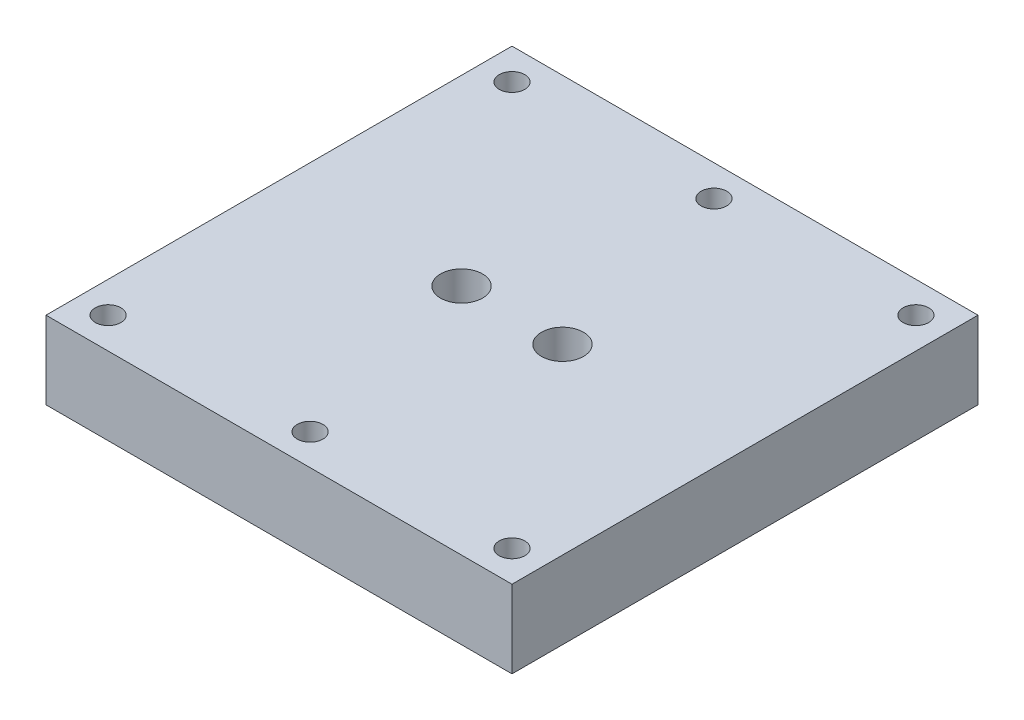
ISO-10303-21;
HEADER;
FILE_DESCRIPTION(('STEP AP214'),'2;1');
FILE_NAME('part.step','',(''),(''),'','','');
FILE_SCHEMA(('AUTOMOTIVE_DESIGN { 1 0 10303 214 1 1 1 1 }'));
ENDSEC;
DATA;
#1=APPLICATION_CONTEXT('core data for automotive mechanical design processes');
#2=APPLICATION_PROTOCOL_DEFINITION('international standard','automotive_design',2000,#1);
#3=PRODUCT_CONTEXT('',#1,'mechanical');
#4=PRODUCT('Part','Part','',(#3));
#5=PRODUCT_RELATED_PRODUCT_CATEGORY('part','',(#4));
#6=PRODUCT_DEFINITION_FORMATION('','',#4);
#7=PRODUCT_DEFINITION_CONTEXT('part definition',#1,'design');
#8=PRODUCT_DEFINITION('design','',#6,#7);
#9=PRODUCT_DEFINITION_SHAPE('','',#8);
#10=(LENGTH_UNIT() NAMED_UNIT(*) SI_UNIT(.MILLI.,.METRE.));
#11=(NAMED_UNIT(*) PLANE_ANGLE_UNIT() SI_UNIT($,.RADIAN.));
#12=(NAMED_UNIT(*) SI_UNIT($,.STERADIAN.) SOLID_ANGLE_UNIT());
#13=UNCERTAINTY_MEASURE_WITH_UNIT(LENGTH_MEASURE(1.E-05),#10,'distance_accuracy_value','');
#14=(GEOMETRIC_REPRESENTATION_CONTEXT(3) GLOBAL_UNCERTAINTY_ASSIGNED_CONTEXT((#13)) GLOBAL_UNIT_ASSIGNED_CONTEXT((#10,
#11,#12)) REPRESENTATION_CONTEXT('',''));
#15=CARTESIAN_POINT('',(0.,0.,0.));
#16=DIRECTION('',(0.,0.,1.));
#17=DIRECTION('',(1.,0.,0.));
#18=AXIS2_PLACEMENT_3D('',#15,#16,#17);
#19=CARTESIAN_POINT('',(-30.,10.,30.));
#20=DIRECTION('',(1.,0.,0.));
#21=DIRECTION('',(0.,0.,-1.));
#22=AXIS2_PLACEMENT_3D('',#19,#20,#21);
#23=PLANE('',#22);
#24=DIRECTION('',(0.,0.,1.));
#25=VECTOR('',#24,1.);
#26=CARTESIAN_POINT('',(-30.,0.,30.));
#27=LINE('',#26,#25);
#28=CARTESIAN_POINT('',(-30.,0.,-30.));
#29=VERTEX_POINT('',#28);
#30=CARTESIAN_POINT('',(-30.,0.,30.));
#31=VERTEX_POINT('',#30);
#32=EDGE_CURVE('E101',#29,#31,#27,.T.);
#33=ORIENTED_EDGE('',*,*,#32,.T.);
#34=DIRECTION('',(0.,-1.,0.));
#35=VECTOR('',#34,1.);
#36=CARTESIAN_POINT('',(-30.,10.,30.));
#37=LINE('',#36,#35);
#38=CARTESIAN_POINT('',(-30.,10.,30.));
#39=VERTEX_POINT('',#38);
#40=EDGE_CURVE('E11',#39,#31,#37,.T.);
#41=ORIENTED_EDGE('',*,*,#40,.F.);
#42=DIRECTION('',(0.,0.,1.));
#43=VECTOR('',#42,1.);
#44=CARTESIAN_POINT('',(-30.,10.,30.));
#45=LINE('',#44,#43);
#46=CARTESIAN_POINT('',(-30.,10.,-30.));
#47=VERTEX_POINT('',#46);
#48=EDGE_CURVE('E89',#47,#39,#45,.T.);
#49=ORIENTED_EDGE('',*,*,#48,.F.);
#50=DIRECTION('',(0.,-1.,0.));
#51=VECTOR('',#50,1.);
#52=CARTESIAN_POINT('',(-30.,10.,-30.));
#53=LINE('',#52,#51);
#54=EDGE_CURVE('E97',#47,#29,#53,.T.);
#55=ORIENTED_EDGE('',*,*,#54,.T.);
#56=EDGE_LOOP('',(#33,#41,#49,#55));
#57=FACE_BOUND('',#56,.T.);
#58=ADVANCED_FACE('F38',(#57),#23,.F.);
#59=CARTESIAN_POINT('',(30.,10.,30.));
#60=DIRECTION('',(0.,0.,-1.));
#61=DIRECTION('',(-1.,0.,0.));
#62=AXIS2_PLACEMENT_3D('',#59,#60,#61);
#63=PLANE('',#62);
#64=DIRECTION('',(1.,0.,0.));
#65=VECTOR('',#64,1.);
#66=CARTESIAN_POINT('',(30.,0.,30.));
#67=LINE('',#66,#65);
#68=CARTESIAN_POINT('',(30.,0.,30.));
#69=VERTEX_POINT('',#68);
#70=EDGE_CURVE('E93',#31,#69,#67,.T.);
#71=ORIENTED_EDGE('',*,*,#70,.T.);
#72=DIRECTION('',(0.,-1.,0.));
#73=VECTOR('',#72,1.);
#74=CARTESIAN_POINT('',(30.,10.,30.));
#75=LINE('',#74,#73);
#76=CARTESIAN_POINT('',(30.,10.,30.));
#77=VERTEX_POINT('',#76);
#78=EDGE_CURVE('E46',#77,#69,#75,.T.);
#79=ORIENTED_EDGE('',*,*,#78,.F.);
#80=DIRECTION('',(1.,0.,0.));
#81=VECTOR('',#80,1.);
#82=CARTESIAN_POINT('',(30.,10.,30.));
#83=LINE('',#82,#81);
#84=EDGE_CURVE('E84',#39,#77,#83,.T.);
#85=ORIENTED_EDGE('',*,*,#84,.F.);
#86=ORIENTED_EDGE('',*,*,#40,.T.);
#87=EDGE_LOOP('',(#71,#79,#85,#86));
#88=FACE_BOUND('',#87,.T.);
#89=ADVANCED_FACE('F92',(#88),#63,.F.);
#90=CARTESIAN_POINT('',(30.,10.,30.));
#91=DIRECTION('',(-1.,0.,0.));
#92=DIRECTION('',(0.,0.,1.));
#93=AXIS2_PLACEMENT_3D('',#90,#91,#92);
#94=PLANE('',#93);
#95=DIRECTION('',(0.,0.,-1.));
#96=VECTOR('',#95,1.);
#97=CARTESIAN_POINT('',(30.,0.,30.));
#98=LINE('',#97,#96);
#99=CARTESIAN_POINT('',(30.,0.,-30.));
#100=VERTEX_POINT('',#99);
#101=EDGE_CURVE('E71',#69,#100,#98,.T.);
#102=ORIENTED_EDGE('',*,*,#101,.T.);
#103=DIRECTION('',(0.,-1.,0.));
#104=VECTOR('',#103,1.);
#105=CARTESIAN_POINT('',(30.,10.,-30.));
#106=LINE('',#105,#104);
#107=CARTESIAN_POINT('',(30.,10.,-30.));
#108=VERTEX_POINT('',#107);
#109=EDGE_CURVE('E94',#108,#100,#106,.T.);
#110=ORIENTED_EDGE('',*,*,#109,.F.);
#111=DIRECTION('',(0.,0.,-1.));
#112=VECTOR('',#111,1.);
#113=CARTESIAN_POINT('',(30.,10.,30.));
#114=LINE('',#113,#112);
#115=EDGE_CURVE('E87',#77,#108,#114,.T.);
#116=ORIENTED_EDGE('',*,*,#115,.F.);
#117=ORIENTED_EDGE('',*,*,#78,.T.);
#118=EDGE_LOOP('',(#102,#110,#116,#117));
#119=FACE_BOUND('',#118,.T.);
#120=ADVANCED_FACE('F95',(#119),#94,.F.);
#121=CARTESIAN_POINT('',(30.,10.,-30.));
#122=DIRECTION('',(0.,0.,1.));
#123=DIRECTION('',(1.,0.,0.));
#124=AXIS2_PLACEMENT_3D('',#121,#122,#123);
#125=PLANE('',#124);
#126=DIRECTION('',(-1.,0.,0.));
#127=VECTOR('',#126,1.);
#128=CARTESIAN_POINT('',(30.,0.,-30.));
#129=LINE('',#128,#127);
#130=EDGE_CURVE('E77',#100,#29,#129,.T.);
#131=ORIENTED_EDGE('',*,*,#130,.T.);
#132=ORIENTED_EDGE('',*,*,#54,.F.);
#133=DIRECTION('',(-1.,0.,0.));
#134=VECTOR('',#133,1.);
#135=CARTESIAN_POINT('',(30.,10.,-30.));
#136=LINE('',#135,#134);
#137=EDGE_CURVE('E54',#108,#47,#136,.T.);
#138=ORIENTED_EDGE('',*,*,#137,.F.);
#139=ORIENTED_EDGE('',*,*,#109,.T.);
#140=EDGE_LOOP('',(#131,#132,#138,#139));
#141=FACE_BOUND('',#140,.T.);
#142=ADVANCED_FACE('F109',(#141),#125,.F.);
#143=CARTESIAN_POINT('',(0.,10.,0.));
#144=DIRECTION('',(0.,1.,0.));
#145=DIRECTION('',(0.,0.,1.));
#146=AXIS2_PLACEMENT_3D('',#143,#144,#145);
#147=PLANE('',#146);
#148=CARTESIAN_POINT('',(-6.5,10.,0.));
#149=DIRECTION('',(0.,1.,0.));
#150=DIRECTION('',(0.,0.,1.));
#151=AXIS2_PLACEMENT_3D('',#148,#149,#150);
#152=CIRCLE('',#151,2.70509999999999);
#153=CARTESIAN_POINT('',(-6.5,10.,2.70509999999999));
#154=VERTEX_POINT('',#153);
#155=EDGE_CURVE('E159',#154,#154,#152,.T.);
#156=ORIENTED_EDGE('',*,*,#155,.F.);
#157=EDGE_LOOP('',(#156));
#158=FACE_BOUND('',#157,.T.);
#159=CARTESIAN_POINT('',(6.5,10.,0.));
#160=DIRECTION('',(0.,1.,0.));
#161=DIRECTION('',(0.,0.,1.));
#162=AXIS2_PLACEMENT_3D('',#159,#160,#161);
#163=CIRCLE('',#162,2.70509999999999);
#164=CARTESIAN_POINT('',(6.5,10.,2.70509999999999));
#165=VERTEX_POINT('',#164);
#166=EDGE_CURVE('E153',#165,#165,#163,.T.);
#167=ORIENTED_EDGE('',*,*,#166,.F.);
#168=EDGE_LOOP('',(#167));
#169=FACE_BOUND('',#168,.T.);
#170=CARTESIAN_POINT('',(0.,10.,-26.));
#171=DIRECTION('',(0.,1.,0.));
#172=DIRECTION('',(0.,0.,1.));
#173=AXIS2_PLACEMENT_3D('',#170,#171,#172);
#174=CIRCLE('',#173,1.65);
#175=CARTESIAN_POINT('',(0.,10.,-24.35));
#176=VERTEX_POINT('',#175);
#177=EDGE_CURVE('E144',#176,#176,#174,.T.);
#178=ORIENTED_EDGE('',*,*,#177,.F.);
#179=EDGE_LOOP('',(#178));
#180=FACE_BOUND('',#179,.T.);
#181=CARTESIAN_POINT('',(-26.,10.,-26.));
#182=DIRECTION('',(0.,1.,0.));
#183=DIRECTION('',(0.,0.,1.));
#184=AXIS2_PLACEMENT_3D('',#181,#182,#183);
#185=CIRCLE('',#184,1.65);
#186=CARTESIAN_POINT('',(-26.,10.,-24.35));
#187=VERTEX_POINT('',#186);
#188=EDGE_CURVE('E138',#187,#187,#185,.T.);
#189=ORIENTED_EDGE('',*,*,#188,.F.);
#190=EDGE_LOOP('',(#189));
#191=FACE_BOUND('',#190,.T.);
#192=CARTESIAN_POINT('',(26.,10.,-26.));
#193=DIRECTION('',(0.,1.,0.));
#194=DIRECTION('',(0.,0.,1.));
#195=AXIS2_PLACEMENT_3D('',#192,#193,#194);
#196=CIRCLE('',#195,1.65);
#197=CARTESIAN_POINT('',(26.,10.,-24.35));
#198=VERTEX_POINT('',#197);
#199=EDGE_CURVE('E132',#198,#198,#196,.T.);
#200=ORIENTED_EDGE('',*,*,#199,.F.);
#201=EDGE_LOOP('',(#200));
#202=FACE_BOUND('',#201,.T.);
#203=CARTESIAN_POINT('',(26.,10.,26.));
#204=DIRECTION('',(0.,1.,0.));
#205=DIRECTION('',(0.,0.,1.));
#206=AXIS2_PLACEMENT_3D('',#203,#204,#205);
#207=CIRCLE('',#206,1.65);
#208=CARTESIAN_POINT('',(26.,10.,27.65));
#209=VERTEX_POINT('',#208);
#210=EDGE_CURVE('E126',#209,#209,#207,.T.);
#211=ORIENTED_EDGE('',*,*,#210,.F.);
#212=EDGE_LOOP('',(#211));
#213=FACE_BOUND('',#212,.T.);
#214=CARTESIAN_POINT('',(0.,10.,26.));
#215=DIRECTION('',(0.,1.,0.));
#216=DIRECTION('',(0.,0.,1.));
#217=AXIS2_PLACEMENT_3D('',#214,#215,#216);
#218=CIRCLE('',#217,1.65);
#219=CARTESIAN_POINT('',(0.,10.,27.65));
#220=VERTEX_POINT('',#219);
#221=EDGE_CURVE('E120',#220,#220,#218,.T.);
#222=ORIENTED_EDGE('',*,*,#221,.F.);
#223=EDGE_LOOP('',(#222));
#224=FACE_BOUND('',#223,.T.);
#225=CARTESIAN_POINT('',(-26.,10.,26.));
#226=DIRECTION('',(0.,1.,0.));
#227=DIRECTION('',(0.,0.,1.));
#228=AXIS2_PLACEMENT_3D('',#225,#226,#227);
#229=CIRCLE('',#228,1.65);
#230=CARTESIAN_POINT('',(-26.,10.,27.65));
#231=VERTEX_POINT('',#230);
#232=EDGE_CURVE('E104',#231,#231,#229,.T.);
#233=ORIENTED_EDGE('',*,*,#232,.F.);
#234=EDGE_LOOP('',(#233));
#235=FACE_BOUND('',#234,.T.);
#236=ORIENTED_EDGE('',*,*,#48,.T.);
#237=ORIENTED_EDGE('',*,*,#84,.T.);
#238=ORIENTED_EDGE('',*,*,#115,.T.);
#239=ORIENTED_EDGE('',*,*,#137,.T.);
#240=EDGE_LOOP('',(#236,#237,#238,#239));
#241=FACE_BOUND('',#240,.T.);
#242=ADVANCED_FACE('F85',(#158,#169,#180,#191,#202,#213,#224,#235,#241),#147,.T.);
#243=CARTESIAN_POINT('',(0.,0.,0.));
#244=DIRECTION('',(0.,1.,0.));
#245=DIRECTION('',(0.,0.,1.));
#246=AXIS2_PLACEMENT_3D('',#243,#244,#245);
#247=PLANE('',#246);
#248=CARTESIAN_POINT('',(-6.5,0.,0.));
#249=DIRECTION('',(0.,1.,0.));
#250=DIRECTION('',(0.,0.,1.));
#251=AXIS2_PLACEMENT_3D('',#248,#249,#250);
#252=CIRCLE('',#251,0.499999999999995);
#253=CARTESIAN_POINT('',(-6.5,0.,0.499999999999995));
#254=VERTEX_POINT('',#253);
#255=EDGE_CURVE('E171',#254,#254,#252,.T.);
#256=ORIENTED_EDGE('',*,*,#255,.T.);
#257=EDGE_LOOP('',(#256));
#258=FACE_BOUND('',#257,.T.);
#259=CARTESIAN_POINT('',(6.5,0.,0.));
#260=DIRECTION('',(0.,1.,0.));
#261=DIRECTION('',(0.,0.,1.));
#262=AXIS2_PLACEMENT_3D('',#259,#260,#261);
#263=CIRCLE('',#262,0.499999999999995);
#264=CARTESIAN_POINT('',(6.5,0.,0.499999999999997));
#265=VERTEX_POINT('',#264);
#266=EDGE_CURVE('E165',#265,#265,#263,.T.);
#267=ORIENTED_EDGE('',*,*,#266,.T.);
#268=EDGE_LOOP('',(#267));
#269=FACE_BOUND('',#268,.T.);
#270=CARTESIAN_POINT('',(0.,0.,-26.));
#271=DIRECTION('',(0.,-1.,0.));
#272=DIRECTION('',(0.,0.,-1.));
#273=AXIS2_PLACEMENT_3D('',#270,#271,#272);
#274=CIRCLE('',#273,1.65);
#275=CARTESIAN_POINT('',(0.,0.,-27.65));
#276=VERTEX_POINT('',#275);
#277=EDGE_CURVE('E147',#276,#276,#274,.T.);
#278=ORIENTED_EDGE('',*,*,#277,.F.);
#279=EDGE_LOOP('',(#278));
#280=FACE_BOUND('',#279,.T.);
#281=CARTESIAN_POINT('',(-26.,0.,-26.));
#282=DIRECTION('',(0.,-1.,0.));
#283=DIRECTION('',(0.,0.,-1.));
#284=AXIS2_PLACEMENT_3D('',#281,#282,#283);
#285=CIRCLE('',#284,1.65);
#286=CARTESIAN_POINT('',(-26.,0.,-27.65));
#287=VERTEX_POINT('',#286);
#288=EDGE_CURVE('E141',#287,#287,#285,.T.);
#289=ORIENTED_EDGE('',*,*,#288,.F.);
#290=EDGE_LOOP('',(#289));
#291=FACE_BOUND('',#290,.T.);
#292=CARTESIAN_POINT('',(26.,0.,-26.));
#293=DIRECTION('',(0.,-1.,0.));
#294=DIRECTION('',(0.,0.,-1.));
#295=AXIS2_PLACEMENT_3D('',#292,#293,#294);
#296=CIRCLE('',#295,1.65);
#297=CARTESIAN_POINT('',(26.,0.,-27.65));
#298=VERTEX_POINT('',#297);
#299=EDGE_CURVE('E135',#298,#298,#296,.T.);
#300=ORIENTED_EDGE('',*,*,#299,.F.);
#301=EDGE_LOOP('',(#300));
#302=FACE_BOUND('',#301,.T.);
#303=CARTESIAN_POINT('',(26.,0.,26.));
#304=DIRECTION('',(0.,-1.,0.));
#305=DIRECTION('',(0.,0.,-1.));
#306=AXIS2_PLACEMENT_3D('',#303,#304,#305);
#307=CIRCLE('',#306,1.65);
#308=CARTESIAN_POINT('',(26.,0.,24.35));
#309=VERTEX_POINT('',#308);
#310=EDGE_CURVE('E129',#309,#309,#307,.T.);
#311=ORIENTED_EDGE('',*,*,#310,.F.);
#312=EDGE_LOOP('',(#311));
#313=FACE_BOUND('',#312,.T.);
#314=CARTESIAN_POINT('',(0.,0.,26.));
#315=DIRECTION('',(0.,-1.,0.));
#316=DIRECTION('',(0.,0.,-1.));
#317=AXIS2_PLACEMENT_3D('',#314,#315,#316);
#318=CIRCLE('',#317,1.65);
#319=CARTESIAN_POINT('',(0.,0.,24.35));
#320=VERTEX_POINT('',#319);
#321=EDGE_CURVE('E123',#320,#320,#318,.T.);
#322=ORIENTED_EDGE('',*,*,#321,.F.);
#323=EDGE_LOOP('',(#322));
#324=FACE_BOUND('',#323,.T.);
#325=CARTESIAN_POINT('',(-26.,0.,26.));
#326=DIRECTION('',(0.,-1.,0.));
#327=DIRECTION('',(0.,0.,-1.));
#328=AXIS2_PLACEMENT_3D('',#325,#326,#327);
#329=CIRCLE('',#328,1.65);
#330=CARTESIAN_POINT('',(-26.,0.,24.35));
#331=VERTEX_POINT('',#330);
#332=EDGE_CURVE('E117',#331,#331,#329,.T.);
#333=ORIENTED_EDGE('',*,*,#332,.F.);
#334=EDGE_LOOP('',(#333));
#335=FACE_BOUND('',#334,.T.);
#336=ORIENTED_EDGE('',*,*,#32,.F.);
#337=ORIENTED_EDGE('',*,*,#130,.F.);
#338=ORIENTED_EDGE('',*,*,#101,.F.);
#339=ORIENTED_EDGE('',*,*,#70,.F.);
#340=EDGE_LOOP('',(#336,#337,#338,#339));
#341=FACE_BOUND('',#340,.T.);
#342=ADVANCED_FACE('F112',(#258,#269,#280,#291,#302,#313,#324,#335,#341),#247,.F.);
#343=CARTESIAN_POINT('',(-26.,0.,26.));
#344=DIRECTION('',(0.,-1.,0.));
#345=DIRECTION('',(0.,0.,-1.));
#346=AXIS2_PLACEMENT_3D('',#343,#344,#345);
#347=CYLINDRICAL_SURFACE('',#346,1.65);
#348=ORIENTED_EDGE('',*,*,#332,.T.);
#349=EDGE_LOOP('',(#348));
#350=FACE_BOUND('',#349,.T.);
#351=ORIENTED_EDGE('',*,*,#232,.T.);
#352=EDGE_LOOP('',(#351));
#353=FACE_BOUND('',#352,.T.);
#354=ADVANCED_FACE('F214',(#350,#353),#347,.F.);
#355=CARTESIAN_POINT('',(0.,0.,26.));
#356=DIRECTION('',(0.,-1.,0.));
#357=DIRECTION('',(0.,0.,-1.));
#358=AXIS2_PLACEMENT_3D('',#355,#356,#357);
#359=CYLINDRICAL_SURFACE('',#358,1.65);
#360=ORIENTED_EDGE('',*,*,#321,.T.);
#361=EDGE_LOOP('',(#360));
#362=FACE_BOUND('',#361,.T.);
#363=ORIENTED_EDGE('',*,*,#221,.T.);
#364=EDGE_LOOP('',(#363));
#365=FACE_BOUND('',#364,.T.);
#366=ADVANCED_FACE('F216',(#362,#365),#359,.F.);
#367=CARTESIAN_POINT('',(26.,0.,26.));
#368=DIRECTION('',(0.,-1.,0.));
#369=DIRECTION('',(0.,0.,-1.));
#370=AXIS2_PLACEMENT_3D('',#367,#368,#369);
#371=CYLINDRICAL_SURFACE('',#370,1.65);
#372=ORIENTED_EDGE('',*,*,#310,.T.);
#373=EDGE_LOOP('',(#372));
#374=FACE_BOUND('',#373,.T.);
#375=ORIENTED_EDGE('',*,*,#210,.T.);
#376=EDGE_LOOP('',(#375));
#377=FACE_BOUND('',#376,.T.);
#378=ADVANCED_FACE('F223',(#374,#377),#371,.F.);
#379=CARTESIAN_POINT('',(26.,0.,-26.));
#380=DIRECTION('',(0.,-1.,0.));
#381=DIRECTION('',(0.,0.,-1.));
#382=AXIS2_PLACEMENT_3D('',#379,#380,#381);
#383=CYLINDRICAL_SURFACE('',#382,1.65);
#384=ORIENTED_EDGE('',*,*,#299,.T.);
#385=EDGE_LOOP('',(#384));
#386=FACE_BOUND('',#385,.T.);
#387=ORIENTED_EDGE('',*,*,#199,.T.);
#388=EDGE_LOOP('',(#387));
#389=FACE_BOUND('',#388,.T.);
#390=ADVANCED_FACE('F349',(#386,#389),#383,.F.);
#391=CARTESIAN_POINT('',(-26.,0.,-26.));
#392=DIRECTION('',(0.,-1.,0.));
#393=DIRECTION('',(0.,0.,-1.));
#394=AXIS2_PLACEMENT_3D('',#391,#392,#393);
#395=CYLINDRICAL_SURFACE('',#394,1.65);
#396=ORIENTED_EDGE('',*,*,#288,.T.);
#397=EDGE_LOOP('',(#396));
#398=FACE_BOUND('',#397,.T.);
#399=ORIENTED_EDGE('',*,*,#188,.T.);
#400=EDGE_LOOP('',(#399));
#401=FACE_BOUND('',#400,.T.);
#402=ADVANCED_FACE('F345',(#398,#401),#395,.F.);
#403=CARTESIAN_POINT('',(0.,0.,-26.));
#404=DIRECTION('',(0.,-1.,0.));
#405=DIRECTION('',(0.,0.,-1.));
#406=AXIS2_PLACEMENT_3D('',#403,#404,#405);
#407=CYLINDRICAL_SURFACE('',#406,1.65);
#408=ORIENTED_EDGE('',*,*,#277,.T.);
#409=EDGE_LOOP('',(#408));
#410=FACE_BOUND('',#409,.T.);
#411=ORIENTED_EDGE('',*,*,#177,.T.);
#412=EDGE_LOOP('',(#411));
#413=FACE_BOUND('',#412,.T.);
#414=ADVANCED_FACE('F267',(#410,#413),#407,.F.);
#415=CARTESIAN_POINT('',(6.5,3.,0.));
#416=DIRECTION('',(0.,1.,0.));
#417=DIRECTION('',(0.,0.,1.));
#418=AXIS2_PLACEMENT_3D('',#415,#416,#417);
#419=CONICAL_SURFACE('',#418,2.7051,1.02974425867665);
#420=CARTESIAN_POINT('',(6.5,1.67504224898233,0.));
#421=DIRECTION('',(0.,1.,0.));
#422=DIRECTION('',(0.,0.,1.));
#423=AXIS2_PLACEMENT_3D('',#420,#421,#422);
#424=CIRCLE('',#423,0.499999999999996);
#425=CARTESIAN_POINT('',(6.5,1.67504224898233,0.499999999999998));
#426=VERTEX_POINT('',#425);
#427=EDGE_CURVE('E162',#426,#426,#424,.F.);
#428=ORIENTED_EDGE('',*,*,#427,.T.);
#429=EDGE_LOOP('',(#428));
#430=FACE_BOUND('',#429,.T.);
#431=CARTESIAN_POINT('',(6.5,3.,0.));
#432=DIRECTION('',(0.,1.,0.));
#433=DIRECTION('',(0.,0.,1.));
#434=AXIS2_PLACEMENT_3D('',#431,#432,#433);
#435=CIRCLE('',#434,2.7051);
#436=CARTESIAN_POINT('',(6.5,3.,2.7051));
#437=VERTEX_POINT('',#436);
#438=EDGE_CURVE('E150',#437,#437,#435,.T.);
#439=ORIENTED_EDGE('',*,*,#438,.T.);
#440=EDGE_LOOP('',(#439));
#441=FACE_BOUND('',#440,.T.);
#442=ADVANCED_FACE('F262',(#430,#441),#419,.F.);
#443=CARTESIAN_POINT('',(6.5,10.,0.));
#444=DIRECTION('',(0.,1.,0.));
#445=DIRECTION('',(0.,0.,1.));
#446=AXIS2_PLACEMENT_3D('',#443,#444,#445);
#447=CYLINDRICAL_SURFACE('',#446,2.70509999999999);
#448=ORIENTED_EDGE('',*,*,#438,.F.);
#449=EDGE_LOOP('',(#448));
#450=FACE_BOUND('',#449,.T.);
#451=ORIENTED_EDGE('',*,*,#166,.T.);
#452=EDGE_LOOP('',(#451));
#453=FACE_BOUND('',#452,.T.);
#454=ADVANCED_FACE('F188',(#450,#453),#447,.F.);
#455=CARTESIAN_POINT('',(-6.5,3.,0.));
#456=DIRECTION('',(0.,1.,0.));
#457=DIRECTION('',(0.,0.,1.));
#458=AXIS2_PLACEMENT_3D('',#455,#456,#457);
#459=CONICAL_SURFACE('',#458,2.7051,1.02974425867665);
#460=CARTESIAN_POINT('',(-6.5,1.67504224898232,0.));
#461=DIRECTION('',(0.,1.,0.));
#462=DIRECTION('',(0.,0.,1.));
#463=AXIS2_PLACEMENT_3D('',#460,#461,#462);
#464=CIRCLE('',#463,0.499999999999996);
#465=CARTESIAN_POINT('',(-6.5,1.67504224898232,0.499999999999996));
#466=VERTEX_POINT('',#465);
#467=EDGE_CURVE('E168',#466,#466,#464,.F.);
#468=ORIENTED_EDGE('',*,*,#467,.T.);
#469=EDGE_LOOP('',(#468));
#470=FACE_BOUND('',#469,.T.);
#471=CARTESIAN_POINT('',(-6.5,3.,0.));
#472=DIRECTION('',(0.,1.,0.));
#473=DIRECTION('',(0.,0.,1.));
#474=AXIS2_PLACEMENT_3D('',#471,#472,#473);
#475=CIRCLE('',#474,2.7051);
#476=CARTESIAN_POINT('',(-6.5,3.,2.7051));
#477=VERTEX_POINT('',#476);
#478=EDGE_CURVE('E156',#477,#477,#475,.T.);
#479=ORIENTED_EDGE('',*,*,#478,.T.);
#480=EDGE_LOOP('',(#479));
#481=FACE_BOUND('',#480,.T.);
#482=ADVANCED_FACE('F184',(#470,#481),#459,.F.);
#483=CARTESIAN_POINT('',(-6.5,10.,0.));
#484=DIRECTION('',(0.,1.,0.));
#485=DIRECTION('',(0.,0.,1.));
#486=AXIS2_PLACEMENT_3D('',#483,#484,#485);
#487=CYLINDRICAL_SURFACE('',#486,2.70509999999999);
#488=ORIENTED_EDGE('',*,*,#478,.F.);
#489=EDGE_LOOP('',(#488));
#490=FACE_BOUND('',#489,.T.);
#491=ORIENTED_EDGE('',*,*,#155,.T.);
#492=EDGE_LOOP('',(#491));
#493=FACE_BOUND('',#492,.T.);
#494=ADVANCED_FACE('F187',(#490,#493),#487,.F.);
#495=CARTESIAN_POINT('',(6.5,10.,0.));
#496=DIRECTION('',(0.,1.,0.));
#497=DIRECTION('',(0.,0.,1.));
#498=AXIS2_PLACEMENT_3D('',#495,#496,#497);
#499=CYLINDRICAL_SURFACE('',#498,0.499999999999996);
#500=ORIENTED_EDGE('',*,*,#266,.F.);
#501=EDGE_LOOP('',(#500));
#502=FACE_BOUND('',#501,.T.);
#503=ORIENTED_EDGE('',*,*,#427,.F.);
#504=EDGE_LOOP('',(#503));
#505=FACE_BOUND('',#504,.T.);
#506=ADVANCED_FACE('F180',(#502,#505),#499,.F.);
#507=CARTESIAN_POINT('',(-6.5,10.,0.));
#508=DIRECTION('',(0.,1.,0.));
#509=DIRECTION('',(0.,0.,1.));
#510=AXIS2_PLACEMENT_3D('',#507,#508,#509);
#511=CYLINDRICAL_SURFACE('',#510,0.499999999999996);
#512=ORIENTED_EDGE('',*,*,#255,.F.);
#513=EDGE_LOOP('',(#512));
#514=FACE_BOUND('',#513,.T.);
#515=ORIENTED_EDGE('',*,*,#467,.F.);
#516=EDGE_LOOP('',(#515));
#517=FACE_BOUND('',#516,.T.);
#518=ADVANCED_FACE('F177',(#514,#517),#511,.F.);
#519=CLOSED_SHELL('',(#58,#89,#120,#142,#242,#342,#354,#366,#378,#390,#402,#414,#442,#454,#482,
#494,#506,#518));
#520=MANIFOLD_SOLID_BREP('B2',#519);
#521=ADVANCED_BREP_SHAPE_REPRESENTATION('',(#18,#520),#14);
#522=SHAPE_DEFINITION_REPRESENTATION(#9,#521);
ENDSEC;
END-ISO-10303-21;
